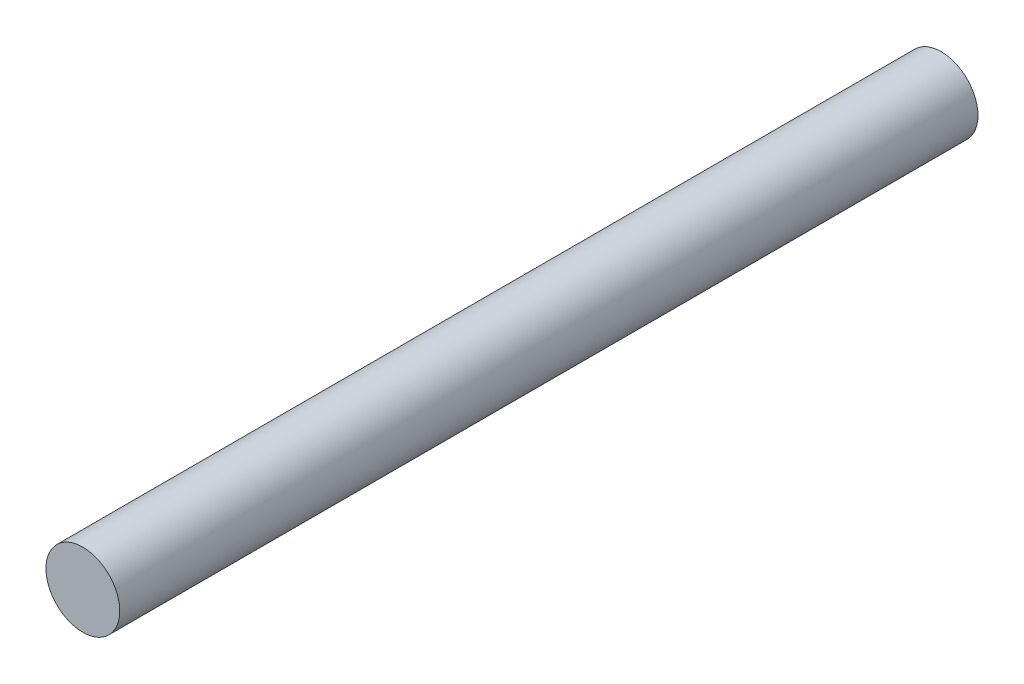
ISO-10303-21;
HEADER;
FILE_DESCRIPTION(('STEP AP214'),'2;1');
FILE_NAME('part.step','',(''),(''),'','','');
FILE_SCHEMA(('AUTOMOTIVE_DESIGN { 1 0 10303 214 1 1 1 1 }'));
ENDSEC;
DATA;
#1=APPLICATION_CONTEXT('core data for automotive mechanical design processes');
#2=APPLICATION_PROTOCOL_DEFINITION('international standard','automotive_design',2000,#1);
#3=PRODUCT_CONTEXT('',#1,'mechanical');
#4=PRODUCT('Part','Part','',(#3));
#5=PRODUCT_RELATED_PRODUCT_CATEGORY('part','',(#4));
#6=PRODUCT_DEFINITION_FORMATION('','',#4);
#7=PRODUCT_DEFINITION_CONTEXT('part definition',#1,'design');
#8=PRODUCT_DEFINITION('design','',#6,#7);
#9=PRODUCT_DEFINITION_SHAPE('','',#8);
#10=(LENGTH_UNIT() NAMED_UNIT(*) SI_UNIT(.MILLI.,.METRE.));
#11=(NAMED_UNIT(*) PLANE_ANGLE_UNIT() SI_UNIT($,.RADIAN.));
#12=(NAMED_UNIT(*) SI_UNIT($,.STERADIAN.) SOLID_ANGLE_UNIT());
#13=UNCERTAINTY_MEASURE_WITH_UNIT(LENGTH_MEASURE(1.E-05),#10,'distance_accuracy_value','');
#14=(GEOMETRIC_REPRESENTATION_CONTEXT(3) GLOBAL_UNCERTAINTY_ASSIGNED_CONTEXT((#13)) GLOBAL_UNIT_ASSIGNED_CONTEXT((#10,
#11,#12)) REPRESENTATION_CONTEXT('',''));
#15=CARTESIAN_POINT('',(0.,0.,0.));
#16=DIRECTION('',(0.,0.,1.));
#17=DIRECTION('',(1.,0.,0.));
#18=AXIS2_PLACEMENT_3D('',#15,#16,#17);
#19=CARTESIAN_POINT('',(0.,0.,254.));
#20=DIRECTION('',(0.,0.,-1.));
#21=DIRECTION('',(-1.,0.,0.));
#22=AXIS2_PLACEMENT_3D('',#19,#20,#21);
#23=CYLINDRICAL_SURFACE('',#22,10.922);
#24=CARTESIAN_POINT('',(0.,0.,254.));
#25=DIRECTION('',(0.,0.,1.));
#26=DIRECTION('',(1.,0.,0.));
#27=AXIS2_PLACEMENT_3D('',#24,#25,#26);
#28=CIRCLE('',#27,10.922);
#29=CARTESIAN_POINT('',(10.922,0.,254.));
#30=VERTEX_POINT('',#29);
#31=EDGE_CURVE('E10',#30,#30,#28,.T.);
#32=ORIENTED_EDGE('',*,*,#31,.F.);
#33=EDGE_LOOP('',(#32));
#34=FACE_BOUND('',#33,.T.);
#35=CARTESIAN_POINT('',(0.,0.,0.));
#36=DIRECTION('',(0.,0.,1.));
#37=DIRECTION('',(1.,0.,0.));
#38=AXIS2_PLACEMENT_3D('',#35,#36,#37);
#39=CIRCLE('',#38,10.922);
#40=CARTESIAN_POINT('',(10.922,0.,0.));
#41=VERTEX_POINT('',#40);
#42=EDGE_CURVE('E34',#41,#41,#39,.T.);
#43=ORIENTED_EDGE('',*,*,#42,.T.);
#44=EDGE_LOOP('',(#43));
#45=FACE_BOUND('',#44,.T.);
#46=ADVANCED_FACE('F31',(#34,#45),#23,.T.);
#47=CARTESIAN_POINT('',(0.,0.,254.));
#48=DIRECTION('',(0.,0.,1.));
#49=DIRECTION('',(1.,0.,0.));
#50=AXIS2_PLACEMENT_3D('',#47,#48,#49);
#51=PLANE('',#50);
#52=ORIENTED_EDGE('',*,*,#31,.T.);
#53=EDGE_LOOP('',(#52));
#54=FACE_BOUND('',#53,.T.);
#55=ADVANCED_FACE('F46',(#54),#51,.T.);
#56=CARTESIAN_POINT('',(0.,0.,0.));
#57=DIRECTION('',(0.,0.,1.));
#58=DIRECTION('',(1.,0.,0.));
#59=AXIS2_PLACEMENT_3D('',#56,#57,#58);
#60=PLANE('',#59);
#61=ORIENTED_EDGE('',*,*,#42,.F.);
#62=EDGE_LOOP('',(#61));
#63=FACE_BOUND('',#62,.T.);
#64=ADVANCED_FACE('F44',(#63),#60,.F.);
#65=CLOSED_SHELL('',(#46,#55,#64));
#66=MANIFOLD_SOLID_BREP('B2',#65);
#67=ADVANCED_BREP_SHAPE_REPRESENTATION('',(#18,#66),#14);
#68=SHAPE_DEFINITION_REPRESENTATION(#9,#67);
ENDSEC;
END-ISO-10303-21;
